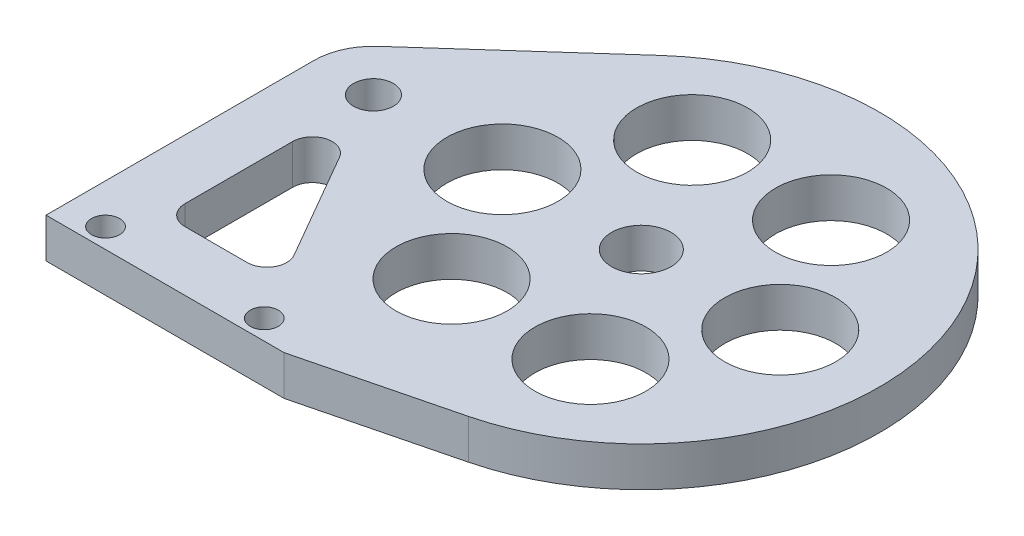
ISO-10303-21;
HEADER;
FILE_DESCRIPTION(('STEP AP214'),'2;1');
FILE_NAME('part.step','',(''),(''),'','','');
FILE_SCHEMA(('AUTOMOTIVE_DESIGN { 1 0 10303 214 1 1 1 1 }'));
ENDSEC;
DATA;
#1=APPLICATION_CONTEXT('core data for automotive mechanical design processes');
#2=APPLICATION_PROTOCOL_DEFINITION('international standard','automotive_design',2000,#1);
#3=PRODUCT_CONTEXT('',#1,'mechanical');
#4=PRODUCT('Part','Part','',(#3));
#5=PRODUCT_RELATED_PRODUCT_CATEGORY('part','',(#4));
#6=PRODUCT_DEFINITION_FORMATION('','',#4);
#7=PRODUCT_DEFINITION_CONTEXT('part definition',#1,'design');
#8=PRODUCT_DEFINITION('design','',#6,#7);
#9=PRODUCT_DEFINITION_SHAPE('','',#8);
#10=(LENGTH_UNIT() NAMED_UNIT(*) SI_UNIT(.MILLI.,.METRE.));
#11=(NAMED_UNIT(*) PLANE_ANGLE_UNIT() SI_UNIT($,.RADIAN.));
#12=(NAMED_UNIT(*) SI_UNIT($,.STERADIAN.) SOLID_ANGLE_UNIT());
#13=UNCERTAINTY_MEASURE_WITH_UNIT(LENGTH_MEASURE(1.E-05),#10,'distance_accuracy_value','');
#14=(GEOMETRIC_REPRESENTATION_CONTEXT(3) GLOBAL_UNCERTAINTY_ASSIGNED_CONTEXT((#13)) GLOBAL_UNIT_ASSIGNED_CONTEXT((#10,
#11,#12)) REPRESENTATION_CONTEXT('',''));
#15=CARTESIAN_POINT('',(0.,0.,0.));
#16=DIRECTION('',(0.,0.,1.));
#17=DIRECTION('',(1.,0.,0.));
#18=AXIS2_PLACEMENT_3D('',#15,#16,#17);
#19=CARTESIAN_POINT('',(38.1,6.35,42.8625));
#20=DIRECTION('',(0.,0.,-1.));
#21=DIRECTION('',(-1.,0.,0.));
#22=AXIS2_PLACEMENT_3D('',#19,#20,#21);
#23=PLANE('',#22);
#24=DIRECTION('',(1.,0.,0.));
#25=VECTOR('',#24,1.);
#26=CARTESIAN_POINT('',(38.1,0.,42.8625));
#27=LINE('',#26,#25);
#28=CARTESIAN_POINT('',(-52.3875,0.,42.8625));
#29=VERTEX_POINT('',#28);
#30=CARTESIAN_POINT('',(-14.2875,0.,42.8625));
#31=VERTEX_POINT('',#30);
#32=EDGE_CURVE('E242',#29,#31,#27,.T.);
#33=ORIENTED_EDGE('',*,*,#32,.T.);
#34=DIRECTION('',(0.,1.,0.));
#35=VECTOR('',#34,1.);
#36=CARTESIAN_POINT('',(-14.2875,0.,42.8625));
#37=LINE('',#36,#35);
#38=CARTESIAN_POINT('',(-14.2875,6.35,42.8625));
#39=VERTEX_POINT('',#38);
#40=EDGE_CURVE('E213',#31,#39,#37,.T.);
#41=ORIENTED_EDGE('',*,*,#40,.T.);
#42=DIRECTION('',(1.,0.,0.));
#43=VECTOR('',#42,1.);
#44=CARTESIAN_POINT('',(38.1,6.35,42.8625));
#45=LINE('',#44,#43);
#46=CARTESIAN_POINT('',(-52.3875,6.35,42.8625));
#47=VERTEX_POINT('',#46);
#48=EDGE_CURVE('E243',#47,#39,#45,.T.);
#49=ORIENTED_EDGE('',*,*,#48,.F.);
#50=DIRECTION('',(0.,-1.,0.));
#51=VECTOR('',#50,1.);
#52=CARTESIAN_POINT('',(-52.3875,6.35,42.8625));
#53=LINE('',#52,#51);
#54=EDGE_CURVE('E255',#47,#29,#53,.T.);
#55=ORIENTED_EDGE('',*,*,#54,.T.);
#56=EDGE_LOOP('',(#33,#41,#49,#55));
#57=FACE_BOUND('',#56,.T.);
#58=ADVANCED_FACE('F33',(#57),#23,.F.);
#59=CARTESIAN_POINT('',(0.,6.35,0.));
#60=DIRECTION('',(0.,-1.,0.));
#61=DIRECTION('',(0.,0.,-1.));
#62=AXIS2_PLACEMENT_3D('',#59,#60,#61);
#63=CYLINDRICAL_SURFACE('',#62,38.1);
#64=CARTESIAN_POINT('',(0.,0.,0.));
#65=DIRECTION('',(0.,1.,0.));
#66=DIRECTION('',(0.,0.,-1.));
#67=AXIS2_PLACEMENT_3D('',#64,#65,#66);
#68=CIRCLE('',#67,38.1);
#69=CARTESIAN_POINT('',(9.26726434678851,0.,36.9557547822628));
#70=VERTEX_POINT('',#69);
#71=CARTESIAN_POINT('',(-25.4,0.,-28.3980633142473));
#72=VERTEX_POINT('',#71);
#73=EDGE_CURVE('E258',#70,#72,#68,.T.);
#74=ORIENTED_EDGE('',*,*,#73,.T.);
#75=DIRECTION('',(0.,-1.,0.));
#76=VECTOR('',#75,1.);
#77=CARTESIAN_POINT('',(-25.4,6.35,-28.3980633142473));
#78=LINE('',#77,#76);
#79=CARTESIAN_POINT('',(-25.4,6.35,-28.3980633142473));
#80=VERTEX_POINT('',#79);
#81=EDGE_CURVE('E11',#80,#72,#78,.T.);
#82=ORIENTED_EDGE('',*,*,#81,.F.);
#83=CARTESIAN_POINT('',(0.,6.35,0.));
#84=DIRECTION('',(0.,1.,0.));
#85=DIRECTION('',(0.,0.,-1.));
#86=AXIS2_PLACEMENT_3D('',#83,#84,#85);
#87=CIRCLE('',#86,38.1);
#88=CARTESIAN_POINT('',(9.26726434678851,6.35,36.9557547822628));
#89=VERTEX_POINT('',#88);
#90=EDGE_CURVE('E246',#89,#80,#87,.T.);
#91=ORIENTED_EDGE('',*,*,#90,.F.);
#92=DIRECTION('',(0.,1.,0.));
#93=VECTOR('',#92,1.);
#94=CARTESIAN_POINT('',(9.26726434678851,0.,36.9557547822628));
#95=LINE('',#94,#93);
#96=EDGE_CURVE('E211',#70,#89,#95,.T.);
#97=ORIENTED_EDGE('',*,*,#96,.F.);
#98=EDGE_LOOP('',(#74,#82,#91,#97));
#99=FACE_BOUND('',#98,.T.);
#100=ADVANCED_FACE('F295',(#99),#63,.T.);
#101=CARTESIAN_POINT('',(-49.2125,6.35,-7.09951582856183));
#102=DIRECTION('',(0.666666666666667,0.,0.74535599249993));
#103=DIRECTION('',(0.74535599249993,0.,-0.666666666666667));
#104=AXIS2_PLACEMENT_3D('',#101,#102,#103);
#105=PLANE('',#104);
#106=DIRECTION('',(-0.74535599249993,0.,0.666666666666667));
#107=VECTOR('',#106,1.);
#108=CARTESIAN_POINT('',(-49.2125,0.,-7.09951582856183));
#109=LINE('',#108,#107);
#110=CARTESIAN_POINT('',(-49.2125,0.,-7.09951582856184));
#111=VERTEX_POINT('',#110);
#112=EDGE_CURVE('E260',#72,#111,#109,.T.);
#113=ORIENTED_EDGE('',*,*,#112,.T.);
#114=DIRECTION('',(0.,-1.,0.));
#115=VECTOR('',#114,1.);
#116=CARTESIAN_POINT('',(-49.2125,6.35,-7.09951582856184));
#117=LINE('',#116,#115);
#118=CARTESIAN_POINT('',(-49.2125,6.35,-7.09951582856184));
#119=VERTEX_POINT('',#118);
#120=EDGE_CURVE('E40',#119,#111,#117,.T.);
#121=ORIENTED_EDGE('',*,*,#120,.F.);
#122=DIRECTION('',(-0.74535599249993,0.,0.666666666666667));
#123=VECTOR('',#122,1.);
#124=CARTESIAN_POINT('',(-49.2125,6.35,-7.09951582856183));
#125=LINE('',#124,#123);
#126=EDGE_CURVE('E249',#80,#119,#125,.T.);
#127=ORIENTED_EDGE('',*,*,#126,.F.);
#128=ORIENTED_EDGE('',*,*,#81,.T.);
#129=EDGE_LOOP('',(#113,#121,#127,#128));
#130=FACE_BOUND('',#129,.T.);
#131=ADVANCED_FACE('F293',(#130),#105,.F.);
#132=CARTESIAN_POINT('',(-42.8625,6.35,0.));
#133=DIRECTION('',(0.,-1.,0.));
#134=DIRECTION('',(0.,0.,-1.));
#135=AXIS2_PLACEMENT_3D('',#132,#133,#134);
#136=CYLINDRICAL_SURFACE('',#135,9.525);
#137=CARTESIAN_POINT('',(-42.8625,0.,0.));
#138=DIRECTION('',(0.,1.,0.));
#139=DIRECTION('',(0.,0.,1.));
#140=AXIS2_PLACEMENT_3D('',#137,#138,#139);
#141=CIRCLE('',#140,9.525);
#142=CARTESIAN_POINT('',(-52.3875,0.,0.));
#143=VERTEX_POINT('',#142);
#144=EDGE_CURVE('E262',#111,#143,#141,.T.);
#145=ORIENTED_EDGE('',*,*,#144,.T.);
#146=DIRECTION('',(0.,-1.,0.));
#147=VECTOR('',#146,1.);
#148=CARTESIAN_POINT('',(-52.3875,6.35,0.));
#149=LINE('',#148,#147);
#150=CARTESIAN_POINT('',(-52.3875,6.35,0.));
#151=VERTEX_POINT('',#150);
#152=EDGE_CURVE('E267',#151,#143,#149,.T.);
#153=ORIENTED_EDGE('',*,*,#152,.F.);
#154=CARTESIAN_POINT('',(-42.8625,6.35,0.));
#155=DIRECTION('',(0.,1.,0.));
#156=DIRECTION('',(0.,0.,1.));
#157=AXIS2_PLACEMENT_3D('',#154,#155,#156);
#158=CIRCLE('',#157,9.525);
#159=EDGE_CURVE('E251',#119,#151,#158,.T.);
#160=ORIENTED_EDGE('',*,*,#159,.F.);
#161=ORIENTED_EDGE('',*,*,#120,.T.);
#162=EDGE_LOOP('',(#145,#153,#160,#161));
#163=FACE_BOUND('',#162,.T.);
#164=ADVANCED_FACE('F274',(#163),#136,.T.);
#165=CARTESIAN_POINT('',(-52.3875,6.35,42.8625));
#166=DIRECTION('',(1.,0.,0.));
#167=DIRECTION('',(0.,0.,-1.));
#168=AXIS2_PLACEMENT_3D('',#165,#166,#167);
#169=PLANE('',#168);
#170=DIRECTION('',(0.,0.,1.));
#171=VECTOR('',#170,1.);
#172=CARTESIAN_POINT('',(-52.3875,0.,42.8625));
#173=LINE('',#172,#171);
#174=EDGE_CURVE('E247',#143,#29,#173,.T.);
#175=ORIENTED_EDGE('',*,*,#174,.T.);
#176=ORIENTED_EDGE('',*,*,#54,.F.);
#177=DIRECTION('',(0.,0.,1.));
#178=VECTOR('',#177,1.);
#179=CARTESIAN_POINT('',(-52.3875,6.35,42.8625));
#180=LINE('',#179,#178);
#181=EDGE_CURVE('E253',#151,#47,#180,.T.);
#182=ORIENTED_EDGE('',*,*,#181,.F.);
#183=ORIENTED_EDGE('',*,*,#152,.T.);
#184=EDGE_LOOP('',(#175,#176,#182,#183));
#185=FACE_BOUND('',#184,.T.);
#186=ADVANCED_FACE('F284',(#185),#169,.F.);
#187=CARTESIAN_POINT('',(-42.8625,6.35,0.));
#188=DIRECTION('',(0.,1.,0.));
#189=DIRECTION('',(0.,0.,1.));
#190=AXIS2_PLACEMENT_3D('',#187,#188,#189);
#191=PLANE('',#190);
#192=CARTESIAN_POINT('',(-11.1125,6.35,-19.2474145991091));
#193=DIRECTION('',(0.,1.,0.));
#194=DIRECTION('',(0.,0.,1.));
#195=AXIS2_PLACEMENT_3D('',#192,#193,#194);
#196=CIRCLE('',#195,8.89);
#197=CARTESIAN_POINT('',(-11.1125,6.35,-10.3574145991091));
#198=VERTEX_POINT('',#197);
#199=EDGE_CURVE('E180',#198,#198,#196,.T.);
#200=ORIENTED_EDGE('',*,*,#199,.F.);
#201=EDGE_LOOP('',(#200));
#202=FACE_BOUND('',#201,.T.);
#203=CARTESIAN_POINT('',(11.1125,6.35,-19.2474145991092));
#204=DIRECTION('',(0.,1.,0.));
#205=DIRECTION('',(0.,0.,1.));
#206=AXIS2_PLACEMENT_3D('',#203,#204,#205);
#207=CIRCLE('',#206,8.89);
#208=CARTESIAN_POINT('',(11.1125,6.35,-10.3574145991092));
#209=VERTEX_POINT('',#208);
#210=EDGE_CURVE('E186',#209,#209,#207,.T.);
#211=ORIENTED_EDGE('',*,*,#210,.F.);
#212=EDGE_LOOP('',(#211));
#213=FACE_BOUND('',#212,.T.);
#214=CARTESIAN_POINT('',(22.225,6.35,0.));
#215=DIRECTION('',(0.,1.,0.));
#216=DIRECTION('',(0.,0.,1.));
#217=AXIS2_PLACEMENT_3D('',#214,#215,#216);
#218=CIRCLE('',#217,8.89);
#219=CARTESIAN_POINT('',(22.225,6.35,8.89));
#220=VERTEX_POINT('',#219);
#221=EDGE_CURVE('E192',#220,#220,#218,.T.);
#222=ORIENTED_EDGE('',*,*,#221,.F.);
#223=EDGE_LOOP('',(#222));
#224=FACE_BOUND('',#223,.T.);
#225=CARTESIAN_POINT('',(11.1125,6.35,19.2474145991091));
#226=DIRECTION('',(0.,1.,0.));
#227=DIRECTION('',(0.,0.,1.));
#228=AXIS2_PLACEMENT_3D('',#225,#226,#227);
#229=CIRCLE('',#228,8.89);
#230=CARTESIAN_POINT('',(11.1125,6.35,28.1374145991091));
#231=VERTEX_POINT('',#230);
#232=EDGE_CURVE('E198',#231,#231,#229,.T.);
#233=ORIENTED_EDGE('',*,*,#232,.F.);
#234=EDGE_LOOP('',(#233));
#235=FACE_BOUND('',#234,.T.);
#236=CARTESIAN_POINT('',(-11.1125,6.35,19.2474145991092));
#237=DIRECTION('',(0.,1.,0.));
#238=DIRECTION('',(0.,0.,1.));
#239=AXIS2_PLACEMENT_3D('',#236,#237,#238);
#240=CIRCLE('',#239,8.89);
#241=CARTESIAN_POINT('',(-11.1125,6.35,28.1374145991091));
#242=VERTEX_POINT('',#241);
#243=EDGE_CURVE('E146',#242,#242,#240,.T.);
#244=ORIENTED_EDGE('',*,*,#243,.F.);
#245=EDGE_LOOP('',(#244));
#246=FACE_BOUND('',#245,.T.);
#247=CARTESIAN_POINT('',(-29.7406571291759,6.35,30.1625));
#248=DIRECTION('',(0.,1.,0.));
#249=DIRECTION('',(0.,0.,-1.));
#250=AXIS2_PLACEMENT_3D('',#247,#248,#249);
#251=CIRCLE('',#250,3.175);
#252=CARTESIAN_POINT('',(-29.740657129176,6.35,33.3375));
#253=VERTEX_POINT('',#252);
#254=CARTESIAN_POINT('',(-26.9910264721604,6.35,28.575));
#255=VERTEX_POINT('',#254);
#256=EDGE_CURVE('E47',#253,#255,#251,.T.);
#257=ORIENTED_EDGE('',*,*,#256,.F.);
#258=DIRECTION('',(1.,0.,0.));
#259=VECTOR('',#258,1.);
#260=CARTESIAN_POINT('',(-39.6875,6.35,33.3375));
#261=LINE('',#260,#259);
#262=CARTESIAN_POINT('',(-39.6875,6.35,33.3375));
#263=VERTEX_POINT('',#262);
#264=EDGE_CURVE('E140',#263,#253,#261,.T.);
#265=ORIENTED_EDGE('',*,*,#264,.F.);
#266=CARTESIAN_POINT('',(-39.6875,6.35,30.1625));
#267=DIRECTION('',(0.,1.,0.));
#268=DIRECTION('',(0.,0.,-1.));
#269=AXIS2_PLACEMENT_3D('',#266,#267,#268);
#270=CIRCLE('',#269,3.175);
#271=CARTESIAN_POINT('',(-42.8625,6.35,30.1625));
#272=VERTEX_POINT('',#271);
#273=EDGE_CURVE('E143',#272,#263,#270,.T.);
#274=ORIENTED_EDGE('',*,*,#273,.F.);
#275=DIRECTION('',(0.,0.,1.));
#276=VECTOR('',#275,1.);
#277=CARTESIAN_POINT('',(-42.8625,6.35,12.9340627728285));
#278=LINE('',#277,#276);
#279=CARTESIAN_POINT('',(-42.8625,6.35,12.9340627728285));
#280=VERTEX_POINT('',#279);
#281=EDGE_CURVE('E162',#280,#272,#278,.T.);
#282=ORIENTED_EDGE('',*,*,#281,.F.);
#283=CARTESIAN_POINT('',(-39.6875,6.35,12.9340627728285));
#284=DIRECTION('',(0.,1.,0.));
#285=DIRECTION('',(0.,0.,1.));
#286=AXIS2_PLACEMENT_3D('',#283,#284,#285);
#287=CIRCLE('',#286,3.175);
#288=CARTESIAN_POINT('',(-36.9378693429844,6.35,11.3465627728285));
#289=VERTEX_POINT('',#288);
#290=EDGE_CURVE('E159',#289,#280,#287,.T.);
#291=ORIENTED_EDGE('',*,*,#290,.F.);
#292=DIRECTION('',(-0.500000000000001,0.,-0.866025403784438));
#293=VECTOR('',#292,1.);
#294=CARTESIAN_POINT('',(-26.9910264721604,6.35,28.575));
#295=LINE('',#294,#293);
#296=EDGE_CURVE('E157',#255,#289,#295,.T.);
#297=ORIENTED_EDGE('',*,*,#296,.F.);
#298=EDGE_LOOP('',(#257,#265,#274,#282,#291,#297));
#299=FACE_BOUND('',#298,.T.);
#300=CARTESIAN_POINT('',(-22.225,6.35,0.));
#301=DIRECTION('',(0.,1.,0.));
#302=DIRECTION('',(0.,0.,1.));
#303=AXIS2_PLACEMENT_3D('',#300,#301,#302);
#304=CIRCLE('',#303,8.89);
#305=CARTESIAN_POINT('',(-22.225,6.35,8.89));
#306=VERTEX_POINT('',#305);
#307=EDGE_CURVE('E179',#306,#306,#304,.T.);
#308=ORIENTED_EDGE('',*,*,#307,.F.);
#309=EDGE_LOOP('',(#308));
#310=FACE_BOUND('',#309,.T.);
#311=DIRECTION('',(-0.96996731711976,0.,0.243235284692612));
#312=VECTOR('',#311,1.);
#313=CARTESIAN_POINT('',(-14.2875,6.35,42.8625));
#314=LINE('',#313,#312);
#315=EDGE_CURVE('E205',#89,#39,#314,.T.);
#316=ORIENTED_EDGE('',*,*,#315,.F.);
#317=ORIENTED_EDGE('',*,*,#90,.T.);
#318=ORIENTED_EDGE('',*,*,#126,.T.);
#319=ORIENTED_EDGE('',*,*,#159,.T.);
#320=ORIENTED_EDGE('',*,*,#181,.T.);
#321=ORIENTED_EDGE('',*,*,#48,.T.);
#322=EDGE_LOOP('',(#316,#317,#318,#319,#320,#321));
#323=FACE_BOUND('',#322,.T.);
#324=CARTESIAN_POINT('',(0.,6.35,0.));
#325=DIRECTION('',(0.,1.,0.));
#326=DIRECTION('',(0.,0.,1.));
#327=AXIS2_PLACEMENT_3D('',#324,#325,#326);
#328=CIRCLE('',#327,4.7625);
#329=CARTESIAN_POINT('',(0.,6.35,4.7625));
#330=VERTEX_POINT('',#329);
#331=EDGE_CURVE('E216',#330,#330,#328,.T.);
#332=ORIENTED_EDGE('',*,*,#331,.F.);
#333=EDGE_LOOP('',(#332));
#334=FACE_BOUND('',#333,.T.);
#335=CARTESIAN_POINT('',(-46.0375,6.35,39.6875));
#336=DIRECTION('',(0.,1.,0.));
#337=DIRECTION('',(0.,0.,1.));
#338=AXIS2_PLACEMENT_3D('',#335,#336,#337);
#339=CIRCLE('',#338,2.2479);
#340=CARTESIAN_POINT('',(-46.0375,6.35,41.9354));
#341=VERTEX_POINT('',#340);
#342=EDGE_CURVE('E222',#341,#341,#339,.T.);
#343=ORIENTED_EDGE('',*,*,#342,.F.);
#344=EDGE_LOOP('',(#343));
#345=FACE_BOUND('',#344,.T.);
#346=CARTESIAN_POINT('',(-20.6375,6.35,39.6875));
#347=DIRECTION('',(0.,1.,0.));
#348=DIRECTION('',(0.,0.,1.));
#349=AXIS2_PLACEMENT_3D('',#346,#347,#348);
#350=CIRCLE('',#349,2.2479);
#351=CARTESIAN_POINT('',(-20.6375,6.35,41.9354));
#352=VERTEX_POINT('',#351);
#353=EDGE_CURVE('E230',#352,#352,#350,.T.);
#354=ORIENTED_EDGE('',*,*,#353,.F.);
#355=EDGE_LOOP('',(#354));
#356=FACE_BOUND('',#355,.T.);
#357=CARTESIAN_POINT('',(-42.8625,6.35,0.));
#358=DIRECTION('',(0.,1.,0.));
#359=DIRECTION('',(0.,0.,1.));
#360=AXIS2_PLACEMENT_3D('',#357,#358,#359);
#361=CIRCLE('',#360,3.175);
#362=CARTESIAN_POINT('',(-42.8625,6.35,3.175));
#363=VERTEX_POINT('',#362);
#364=EDGE_CURVE('E236',#363,#363,#361,.T.);
#365=ORIENTED_EDGE('',*,*,#364,.F.);
#366=EDGE_LOOP('',(#365));
#367=FACE_BOUND('',#366,.T.);
#368=ADVANCED_FACE('F290',(#202,#213,#224,#235,#246,#299,#310,#323,#334,#345,#356,#367),#191,.T.);
#369=CARTESIAN_POINT('',(-42.8625,0.,0.));
#370=DIRECTION('',(0.,1.,0.));
#371=DIRECTION('',(0.,0.,1.));
#372=AXIS2_PLACEMENT_3D('',#369,#370,#371);
#373=PLANE('',#372);
#374=CARTESIAN_POINT('',(-11.1125,0.,-19.2474145991091));
#375=DIRECTION('',(0.,1.,0.));
#376=DIRECTION('',(0.,0.,1.));
#377=AXIS2_PLACEMENT_3D('',#374,#375,#376);
#378=CIRCLE('',#377,8.89);
#379=CARTESIAN_POINT('',(-11.1125,0.,-10.3574145991091));
#380=VERTEX_POINT('',#379);
#381=EDGE_CURVE('E176',#380,#380,#378,.T.);
#382=ORIENTED_EDGE('',*,*,#381,.T.);
#383=EDGE_LOOP('',(#382));
#384=FACE_BOUND('',#383,.T.);
#385=CARTESIAN_POINT('',(11.1125,0.,-19.2474145991092));
#386=DIRECTION('',(0.,1.,0.));
#387=DIRECTION('',(0.,0.,1.));
#388=AXIS2_PLACEMENT_3D('',#385,#386,#387);
#389=CIRCLE('',#388,8.89);
#390=CARTESIAN_POINT('',(11.1125,0.,-10.3574145991092));
#391=VERTEX_POINT('',#390);
#392=EDGE_CURVE('E183',#391,#391,#389,.T.);
#393=ORIENTED_EDGE('',*,*,#392,.T.);
#394=EDGE_LOOP('',(#393));
#395=FACE_BOUND('',#394,.T.);
#396=CARTESIAN_POINT('',(22.225,0.,0.));
#397=DIRECTION('',(0.,1.,0.));
#398=DIRECTION('',(0.,0.,1.));
#399=AXIS2_PLACEMENT_3D('',#396,#397,#398);
#400=CIRCLE('',#399,8.89);
#401=CARTESIAN_POINT('',(22.225,0.,8.89));
#402=VERTEX_POINT('',#401);
#403=EDGE_CURVE('E189',#402,#402,#400,.T.);
#404=ORIENTED_EDGE('',*,*,#403,.T.);
#405=EDGE_LOOP('',(#404));
#406=FACE_BOUND('',#405,.T.);
#407=CARTESIAN_POINT('',(11.1125,0.,19.2474145991091));
#408=DIRECTION('',(0.,1.,0.));
#409=DIRECTION('',(0.,0.,1.));
#410=AXIS2_PLACEMENT_3D('',#407,#408,#409);
#411=CIRCLE('',#410,8.89);
#412=CARTESIAN_POINT('',(11.1125,0.,28.1374145991091));
#413=VERTEX_POINT('',#412);
#414=EDGE_CURVE('E195',#413,#413,#411,.T.);
#415=ORIENTED_EDGE('',*,*,#414,.T.);
#416=EDGE_LOOP('',(#415));
#417=FACE_BOUND('',#416,.T.);
#418=CARTESIAN_POINT('',(-11.1125,0.,19.2474145991092));
#419=DIRECTION('',(0.,1.,0.));
#420=DIRECTION('',(0.,0.,1.));
#421=AXIS2_PLACEMENT_3D('',#418,#419,#420);
#422=CIRCLE('',#421,8.89);
#423=CARTESIAN_POINT('',(-11.1125,0.,28.1374145991091));
#424=VERTEX_POINT('',#423);
#425=EDGE_CURVE('E201',#424,#424,#422,.T.);
#426=ORIENTED_EDGE('',*,*,#425,.T.);
#427=EDGE_LOOP('',(#426));
#428=FACE_BOUND('',#427,.T.);
#429=DIRECTION('',(1.,0.,0.));
#430=VECTOR('',#429,1.);
#431=CARTESIAN_POINT('',(-39.6875,0.,33.3375));
#432=LINE('',#431,#430);
#433=CARTESIAN_POINT('',(-39.6875,0.,33.3375));
#434=VERTEX_POINT('',#433);
#435=CARTESIAN_POINT('',(-29.740657129176,0.,33.3375));
#436=VERTEX_POINT('',#435);
#437=EDGE_CURVE('E129',#434,#436,#432,.T.);
#438=ORIENTED_EDGE('',*,*,#437,.T.);
#439=CARTESIAN_POINT('',(-29.7406571291759,0.,30.1625));
#440=DIRECTION('',(0.,1.,0.));
#441=DIRECTION('',(0.,0.,-1.));
#442=AXIS2_PLACEMENT_3D('',#439,#440,#441);
#443=CIRCLE('',#442,3.175);
#444=CARTESIAN_POINT('',(-26.9910264721604,0.,28.575));
#445=VERTEX_POINT('',#444);
#446=EDGE_CURVE('E123',#436,#445,#443,.T.);
#447=ORIENTED_EDGE('',*,*,#446,.T.);
#448=DIRECTION('',(-0.500000000000001,0.,-0.866025403784438));
#449=VECTOR('',#448,1.);
#450=CARTESIAN_POINT('',(-26.9910264721604,0.,28.575));
#451=LINE('',#450,#449);
#452=CARTESIAN_POINT('',(-36.9378693429844,0.,11.3465627728285));
#453=VERTEX_POINT('',#452);
#454=EDGE_CURVE('E132',#445,#453,#451,.T.);
#455=ORIENTED_EDGE('',*,*,#454,.T.);
#456=CARTESIAN_POINT('',(-39.6875,0.,12.9340627728285));
#457=DIRECTION('',(0.,1.,0.));
#458=DIRECTION('',(0.,0.,1.));
#459=AXIS2_PLACEMENT_3D('',#456,#457,#458);
#460=CIRCLE('',#459,3.175);
#461=CARTESIAN_POINT('',(-42.8625,0.,12.9340627728285));
#462=VERTEX_POINT('',#461);
#463=EDGE_CURVE('E55',#453,#462,#460,.T.);
#464=ORIENTED_EDGE('',*,*,#463,.T.);
#465=DIRECTION('',(0.,0.,1.));
#466=VECTOR('',#465,1.);
#467=CARTESIAN_POINT('',(-42.8625,0.,12.9340627728285));
#468=LINE('',#467,#466);
#469=CARTESIAN_POINT('',(-42.8625,0.,30.1625));
#470=VERTEX_POINT('',#469);
#471=EDGE_CURVE('E150',#462,#470,#468,.T.);
#472=ORIENTED_EDGE('',*,*,#471,.T.);
#473=CARTESIAN_POINT('',(-39.6875,0.,30.1625));
#474=DIRECTION('',(0.,1.,0.));
#475=DIRECTION('',(0.,0.,-1.));
#476=AXIS2_PLACEMENT_3D('',#473,#474,#475);
#477=CIRCLE('',#476,3.175);
#478=EDGE_CURVE('E153',#470,#434,#477,.T.);
#479=ORIENTED_EDGE('',*,*,#478,.T.);
#480=EDGE_LOOP('',(#438,#447,#455,#464,#472,#479));
#481=FACE_BOUND('',#480,.T.);
#482=CARTESIAN_POINT('',(-22.225,0.,0.));
#483=DIRECTION('',(0.,1.,0.));
#484=DIRECTION('',(0.,0.,1.));
#485=AXIS2_PLACEMENT_3D('',#482,#483,#484);
#486=CIRCLE('',#485,8.89);
#487=CARTESIAN_POINT('',(-22.225,0.,8.89));
#488=VERTEX_POINT('',#487);
#489=EDGE_CURVE('E202',#488,#488,#486,.T.);
#490=ORIENTED_EDGE('',*,*,#489,.T.);
#491=EDGE_LOOP('',(#490));
#492=FACE_BOUND('',#491,.T.);
#493=CARTESIAN_POINT('',(0.,0.,0.));
#494=DIRECTION('',(0.,1.,0.));
#495=DIRECTION('',(0.,0.,1.));
#496=AXIS2_PLACEMENT_3D('',#493,#494,#495);
#497=CIRCLE('',#496,4.7625);
#498=CARTESIAN_POINT('',(0.,0.,4.7625));
#499=VERTEX_POINT('',#498);
#500=EDGE_CURVE('E219',#499,#499,#497,.T.);
#501=ORIENTED_EDGE('',*,*,#500,.T.);
#502=EDGE_LOOP('',(#501));
#503=FACE_BOUND('',#502,.T.);
#504=CARTESIAN_POINT('',(-46.0375,0.,39.6875));
#505=DIRECTION('',(0.,1.,0.));
#506=DIRECTION('',(0.,0.,1.));
#507=AXIS2_PLACEMENT_3D('',#504,#505,#506);
#508=CIRCLE('',#507,2.2479);
#509=CARTESIAN_POINT('',(-46.0375,0.,41.9354));
#510=VERTEX_POINT('',#509);
#511=EDGE_CURVE('E227',#510,#510,#508,.T.);
#512=ORIENTED_EDGE('',*,*,#511,.T.);
#513=EDGE_LOOP('',(#512));
#514=FACE_BOUND('',#513,.T.);
#515=CARTESIAN_POINT('',(-20.6375,0.,39.6875));
#516=DIRECTION('',(0.,1.,0.));
#517=DIRECTION('',(0.,0.,1.));
#518=AXIS2_PLACEMENT_3D('',#515,#516,#517);
#519=CIRCLE('',#518,2.2479);
#520=CARTESIAN_POINT('',(-20.6375,0.,41.9354));
#521=VERTEX_POINT('',#520);
#522=EDGE_CURVE('E233',#521,#521,#519,.T.);
#523=ORIENTED_EDGE('',*,*,#522,.T.);
#524=EDGE_LOOP('',(#523));
#525=FACE_BOUND('',#524,.T.);
#526=CARTESIAN_POINT('',(-42.8625,0.,0.));
#527=DIRECTION('',(0.,1.,0.));
#528=DIRECTION('',(0.,0.,1.));
#529=AXIS2_PLACEMENT_3D('',#526,#527,#528);
#530=CIRCLE('',#529,3.175);
#531=CARTESIAN_POINT('',(-42.8625,0.,3.175));
#532=VERTEX_POINT('',#531);
#533=EDGE_CURVE('E239',#532,#532,#530,.T.);
#534=ORIENTED_EDGE('',*,*,#533,.T.);
#535=EDGE_LOOP('',(#534));
#536=FACE_BOUND('',#535,.T.);
#537=ORIENTED_EDGE('',*,*,#73,.F.);
#538=DIRECTION('',(-0.96996731711976,0.,0.243235284692612));
#539=VECTOR('',#538,1.);
#540=CARTESIAN_POINT('',(-14.2875,0.,42.8625));
#541=LINE('',#540,#539);
#542=EDGE_CURVE('E208',#70,#31,#541,.T.);
#543=ORIENTED_EDGE('',*,*,#542,.T.);
#544=ORIENTED_EDGE('',*,*,#32,.F.);
#545=ORIENTED_EDGE('',*,*,#174,.F.);
#546=ORIENTED_EDGE('',*,*,#144,.F.);
#547=ORIENTED_EDGE('',*,*,#112,.F.);
#548=EDGE_LOOP('',(#537,#543,#544,#545,#546,#547));
#549=FACE_BOUND('',#548,.T.);
#550=ADVANCED_FACE('F136',(#384,#395,#406,#417,#428,#481,#492,#503,#514,#525,#536,#549),#373,.F.);
#551=CARTESIAN_POINT('',(-42.8625,6.35,0.));
#552=DIRECTION('',(0.,1.,0.));
#553=DIRECTION('',(0.,0.,1.));
#554=AXIS2_PLACEMENT_3D('',#551,#552,#553);
#555=CYLINDRICAL_SURFACE('',#554,3.175);
#556=ORIENTED_EDGE('',*,*,#364,.T.);
#557=EDGE_LOOP('',(#556));
#558=FACE_BOUND('',#557,.T.);
#559=ORIENTED_EDGE('',*,*,#533,.F.);
#560=EDGE_LOOP('',(#559));
#561=FACE_BOUND('',#560,.T.);
#562=ADVANCED_FACE('F328',(#558,#561),#555,.F.);
#563=CARTESIAN_POINT('',(-20.6375,6.35,39.6875));
#564=DIRECTION('',(0.,1.,0.));
#565=DIRECTION('',(0.,0.,1.));
#566=AXIS2_PLACEMENT_3D('',#563,#564,#565);
#567=CYLINDRICAL_SURFACE('',#566,2.2479);
#568=ORIENTED_EDGE('',*,*,#353,.T.);
#569=EDGE_LOOP('',(#568));
#570=FACE_BOUND('',#569,.T.);
#571=ORIENTED_EDGE('',*,*,#522,.F.);
#572=EDGE_LOOP('',(#571));
#573=FACE_BOUND('',#572,.T.);
#574=ADVANCED_FACE('F335',(#570,#573),#567,.F.);
#575=CARTESIAN_POINT('',(-46.0375,6.35,39.6875));
#576=DIRECTION('',(0.,1.,0.));
#577=DIRECTION('',(0.,0.,1.));
#578=AXIS2_PLACEMENT_3D('',#575,#576,#577);
#579=CYLINDRICAL_SURFACE('',#578,2.2479);
#580=ORIENTED_EDGE('',*,*,#342,.T.);
#581=EDGE_LOOP('',(#580));
#582=FACE_BOUND('',#581,.T.);
#583=ORIENTED_EDGE('',*,*,#511,.F.);
#584=EDGE_LOOP('',(#583));
#585=FACE_BOUND('',#584,.T.);
#586=ADVANCED_FACE('F310',(#582,#585),#579,.F.);
#587=CARTESIAN_POINT('',(0.,0.,0.));
#588=DIRECTION('',(0.,1.,0.));
#589=DIRECTION('',(0.,0.,1.));
#590=AXIS2_PLACEMENT_3D('',#587,#588,#589);
#591=CYLINDRICAL_SURFACE('',#590,4.7625);
#592=ORIENTED_EDGE('',*,*,#500,.F.);
#593=EDGE_LOOP('',(#592));
#594=FACE_BOUND('',#593,.T.);
#595=ORIENTED_EDGE('',*,*,#331,.T.);
#596=EDGE_LOOP('',(#595));
#597=FACE_BOUND('',#596,.T.);
#598=ADVANCED_FACE('F302',(#594,#597),#591,.F.);
#599=CARTESIAN_POINT('',(-14.2875,0.,42.8625));
#600=DIRECTION('',(-0.243235284692612,0.,-0.969967317119759));
#601=DIRECTION('',(-0.96996731711976,0.,0.243235284692612));
#602=AXIS2_PLACEMENT_3D('',#599,#600,#601);
#603=PLANE('',#602);
#604=ORIENTED_EDGE('',*,*,#315,.T.);
#605=ORIENTED_EDGE('',*,*,#40,.F.);
#606=ORIENTED_EDGE('',*,*,#542,.F.);
#607=ORIENTED_EDGE('',*,*,#96,.T.);
#608=EDGE_LOOP('',(#604,#605,#606,#607));
#609=FACE_BOUND('',#608,.T.);
#610=ADVANCED_FACE('F299',(#609),#603,.F.);
#611=CARTESIAN_POINT('',(-22.225,0.,0.));
#612=DIRECTION('',(0.,1.,0.));
#613=DIRECTION('',(0.,0.,1.));
#614=AXIS2_PLACEMENT_3D('',#611,#612,#613);
#615=CYLINDRICAL_SURFACE('',#614,8.89);
#616=ORIENTED_EDGE('',*,*,#489,.F.);
#617=EDGE_LOOP('',(#616));
#618=FACE_BOUND('',#617,.T.);
#619=ORIENTED_EDGE('',*,*,#307,.T.);
#620=EDGE_LOOP('',(#619));
#621=FACE_BOUND('',#620,.T.);
#622=ADVANCED_FACE('F301',(#618,#621),#615,.F.);
#623=CARTESIAN_POINT('',(-29.7406571291759,0.,30.1625));
#624=DIRECTION('',(0.,1.,0.));
#625=DIRECTION('',(0.,0.,1.));
#626=AXIS2_PLACEMENT_3D('',#623,#624,#625);
#627=CYLINDRICAL_SURFACE('',#626,3.175);
#628=ORIENTED_EDGE('',*,*,#256,.T.);
#629=DIRECTION('',(0.,1.,0.));
#630=VECTOR('',#629,1.);
#631=CARTESIAN_POINT('',(-26.9910264721604,0.,28.575));
#632=LINE('',#631,#630);
#633=EDGE_CURVE('E119',#445,#255,#632,.T.);
#634=ORIENTED_EDGE('',*,*,#633,.F.);
#635=ORIENTED_EDGE('',*,*,#446,.F.);
#636=DIRECTION('',(0.,1.,0.));
#637=VECTOR('',#636,1.);
#638=CARTESIAN_POINT('',(-29.740657129176,0.,33.3375));
#639=LINE('',#638,#637);
#640=EDGE_CURVE('E167',#436,#253,#639,.T.);
#641=ORIENTED_EDGE('',*,*,#640,.T.);
#642=EDGE_LOOP('',(#628,#634,#635,#641));
#643=FACE_BOUND('',#642,.T.);
#644=ADVANCED_FACE('F121',(#643),#627,.F.);
#645=CARTESIAN_POINT('',(-39.6875,0.,33.3375));
#646=DIRECTION('',(0.,0.,1.));
#647=DIRECTION('',(1.,0.,0.));
#648=AXIS2_PLACEMENT_3D('',#645,#646,#647);
#649=PLANE('',#648);
#650=ORIENTED_EDGE('',*,*,#264,.T.);
#651=ORIENTED_EDGE('',*,*,#640,.F.);
#652=ORIENTED_EDGE('',*,*,#437,.F.);
#653=DIRECTION('',(0.,1.,0.));
#654=VECTOR('',#653,1.);
#655=CARTESIAN_POINT('',(-39.6875,0.,33.3375));
#656=LINE('',#655,#654);
#657=EDGE_CURVE('E169',#434,#263,#656,.T.);
#658=ORIENTED_EDGE('',*,*,#657,.T.);
#659=EDGE_LOOP('',(#650,#651,#652,#658));
#660=FACE_BOUND('',#659,.T.);
#661=ADVANCED_FACE('F407',(#660),#649,.F.);
#662=CARTESIAN_POINT('',(-39.6875,0.,30.1625));
#663=DIRECTION('',(0.,1.,0.));
#664=DIRECTION('',(0.,0.,1.));
#665=AXIS2_PLACEMENT_3D('',#662,#663,#664);
#666=CYLINDRICAL_SURFACE('',#665,3.175);
#667=ORIENTED_EDGE('',*,*,#273,.T.);
#668=ORIENTED_EDGE('',*,*,#657,.F.);
#669=ORIENTED_EDGE('',*,*,#478,.F.);
#670=DIRECTION('',(0.,1.,0.));
#671=VECTOR('',#670,1.);
#672=CARTESIAN_POINT('',(-42.8625,0.,30.1625));
#673=LINE('',#672,#671);
#674=EDGE_CURVE('E171',#470,#272,#673,.T.);
#675=ORIENTED_EDGE('',*,*,#674,.T.);
#676=EDGE_LOOP('',(#667,#668,#669,#675));
#677=FACE_BOUND('',#676,.T.);
#678=ADVANCED_FACE('F416',(#677),#666,.F.);
#679=CARTESIAN_POINT('',(-42.8625,0.,12.9340627728285));
#680=DIRECTION('',(-1.,0.,0.));
#681=DIRECTION('',(0.,0.,1.));
#682=AXIS2_PLACEMENT_3D('',#679,#680,#681);
#683=PLANE('',#682);
#684=ORIENTED_EDGE('',*,*,#281,.T.);
#685=ORIENTED_EDGE('',*,*,#674,.F.);
#686=ORIENTED_EDGE('',*,*,#471,.F.);
#687=DIRECTION('',(0.,1.,0.));
#688=VECTOR('',#687,1.);
#689=CARTESIAN_POINT('',(-42.8625,0.,12.9340627728285));
#690=LINE('',#689,#688);
#691=EDGE_CURVE('E173',#462,#280,#690,.T.);
#692=ORIENTED_EDGE('',*,*,#691,.T.);
#693=EDGE_LOOP('',(#684,#685,#686,#692));
#694=FACE_BOUND('',#693,.T.);
#695=ADVANCED_FACE('F426',(#694),#683,.F.);
#696=CARTESIAN_POINT('',(-39.6875,0.,12.9340627728285));
#697=DIRECTION('',(0.,1.,0.));
#698=DIRECTION('',(0.,0.,1.));
#699=AXIS2_PLACEMENT_3D('',#696,#697,#698);
#700=CYLINDRICAL_SURFACE('',#699,3.175);
#701=ORIENTED_EDGE('',*,*,#290,.T.);
#702=ORIENTED_EDGE('',*,*,#691,.F.);
#703=ORIENTED_EDGE('',*,*,#463,.F.);
#704=DIRECTION('',(0.,1.,0.));
#705=VECTOR('',#704,1.);
#706=CARTESIAN_POINT('',(-36.9378693429844,0.,11.3465627728285));
#707=LINE('',#706,#705);
#708=EDGE_CURVE('E128',#453,#289,#707,.T.);
#709=ORIENTED_EDGE('',*,*,#708,.T.);
#710=EDGE_LOOP('',(#701,#702,#703,#709));
#711=FACE_BOUND('',#710,.T.);
#712=ADVANCED_FACE('F436',(#711),#700,.F.);
#713=CARTESIAN_POINT('',(-26.9910264721604,0.,28.575));
#714=DIRECTION('',(0.866025403784438,0.,-0.500000000000001));
#715=DIRECTION('',(-0.500000000000001,0.,-0.866025403784438));
#716=AXIS2_PLACEMENT_3D('',#713,#714,#715);
#717=PLANE('',#716);
#718=ORIENTED_EDGE('',*,*,#296,.T.);
#719=ORIENTED_EDGE('',*,*,#708,.F.);
#720=ORIENTED_EDGE('',*,*,#454,.F.);
#721=ORIENTED_EDGE('',*,*,#633,.T.);
#722=EDGE_LOOP('',(#718,#719,#720,#721));
#723=FACE_BOUND('',#722,.T.);
#724=ADVANCED_FACE('F133',(#723),#717,.F.);
#725=CARTESIAN_POINT('',(-11.1125,0.,19.2474145991092));
#726=DIRECTION('',(0.,1.,0.));
#727=DIRECTION('',(0.,0.,1.));
#728=AXIS2_PLACEMENT_3D('',#725,#726,#727);
#729=CYLINDRICAL_SURFACE('',#728,8.89);
#730=ORIENTED_EDGE('',*,*,#425,.F.);
#731=EDGE_LOOP('',(#730));
#732=FACE_BOUND('',#731,.T.);
#733=ORIENTED_EDGE('',*,*,#243,.T.);
#734=EDGE_LOOP('',(#733));
#735=FACE_BOUND('',#734,.T.);
#736=ADVANCED_FACE('F454',(#732,#735),#729,.F.);
#737=CARTESIAN_POINT('',(11.1125,0.,19.2474145991091));
#738=DIRECTION('',(0.,1.,0.));
#739=DIRECTION('',(0.,0.,1.));
#740=AXIS2_PLACEMENT_3D('',#737,#738,#739);
#741=CYLINDRICAL_SURFACE('',#740,8.89);
#742=ORIENTED_EDGE('',*,*,#414,.F.);
#743=EDGE_LOOP('',(#742));
#744=FACE_BOUND('',#743,.T.);
#745=ORIENTED_EDGE('',*,*,#232,.T.);
#746=EDGE_LOOP('',(#745));
#747=FACE_BOUND('',#746,.T.);
#748=ADVANCED_FACE('F463',(#744,#747),#741,.F.);
#749=CARTESIAN_POINT('',(22.225,0.,0.));
#750=DIRECTION('',(0.,1.,0.));
#751=DIRECTION('',(0.,0.,1.));
#752=AXIS2_PLACEMENT_3D('',#749,#750,#751);
#753=CYLINDRICAL_SURFACE('',#752,8.89);
#754=ORIENTED_EDGE('',*,*,#403,.F.);
#755=EDGE_LOOP('',(#754));
#756=FACE_BOUND('',#755,.T.);
#757=ORIENTED_EDGE('',*,*,#221,.T.);
#758=EDGE_LOOP('',(#757));
#759=FACE_BOUND('',#758,.T.);
#760=ADVANCED_FACE('F473',(#756,#759),#753,.F.);
#761=CARTESIAN_POINT('',(11.1125,0.,-19.2474145991092));
#762=DIRECTION('',(0.,1.,0.));
#763=DIRECTION('',(0.,0.,1.));
#764=AXIS2_PLACEMENT_3D('',#761,#762,#763);
#765=CYLINDRICAL_SURFACE('',#764,8.89);
#766=ORIENTED_EDGE('',*,*,#392,.F.);
#767=EDGE_LOOP('',(#766));
#768=FACE_BOUND('',#767,.T.);
#769=ORIENTED_EDGE('',*,*,#210,.T.);
#770=EDGE_LOOP('',(#769));
#771=FACE_BOUND('',#770,.T.);
#772=ADVANCED_FACE('F483',(#768,#771),#765,.F.);
#773=CARTESIAN_POINT('',(-11.1125,0.,-19.2474145991091));
#774=DIRECTION('',(0.,1.,0.));
#775=DIRECTION('',(0.,0.,1.));
#776=AXIS2_PLACEMENT_3D('',#773,#774,#775);
#777=CYLINDRICAL_SURFACE('',#776,8.89);
#778=ORIENTED_EDGE('',*,*,#381,.F.);
#779=EDGE_LOOP('',(#778));
#780=FACE_BOUND('',#779,.T.);
#781=ORIENTED_EDGE('',*,*,#199,.T.);
#782=EDGE_LOOP('',(#781));
#783=FACE_BOUND('',#782,.T.);
#784=ADVANCED_FACE('F493',(#780,#783),#777,.F.);
#785=CLOSED_SHELL('',(#58,#100,#131,#164,#186,#368,#550,#562,#574,#586,#598,#610,#622,#644,#661,
#678,#695,#712,#724,#736,#748,#760,#772,#784));
#786=MANIFOLD_SOLID_BREP('B2',#785);
#787=ADVANCED_BREP_SHAPE_REPRESENTATION('',(#18,#786),#14);
#788=SHAPE_DEFINITION_REPRESENTATION(#9,#787);
ENDSEC;
END-ISO-10303-21;
